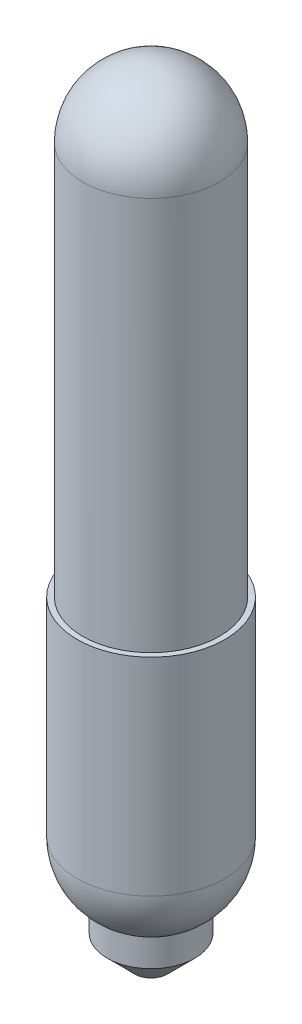
ISO-10303-21;
HEADER;
FILE_DESCRIPTION(('STEP AP214'),'2;1');
FILE_NAME('part.step','',(''),(''),'','','');
FILE_SCHEMA(('AUTOMOTIVE_DESIGN { 1 0 10303 214 1 1 1 1 }'));
ENDSEC;
DATA;
#1=APPLICATION_CONTEXT('core data for automotive mechanical design processes');
#2=APPLICATION_PROTOCOL_DEFINITION('international standard','automotive_design',2000,#1);
#3=PRODUCT_CONTEXT('',#1,'mechanical');
#4=PRODUCT('Part','Part','',(#3));
#5=PRODUCT_RELATED_PRODUCT_CATEGORY('part','',(#4));
#6=PRODUCT_DEFINITION_FORMATION('','',#4);
#7=PRODUCT_DEFINITION_CONTEXT('part definition',#1,'design');
#8=PRODUCT_DEFINITION('design','',#6,#7);
#9=PRODUCT_DEFINITION_SHAPE('','',#8);
#10=(LENGTH_UNIT() NAMED_UNIT(*) SI_UNIT(.MILLI.,.METRE.));
#11=(NAMED_UNIT(*) PLANE_ANGLE_UNIT() SI_UNIT($,.RADIAN.));
#12=(NAMED_UNIT(*) SI_UNIT($,.STERADIAN.) SOLID_ANGLE_UNIT());
#13=UNCERTAINTY_MEASURE_WITH_UNIT(LENGTH_MEASURE(1.E-05),#10,'distance_accuracy_value','');
#14=(GEOMETRIC_REPRESENTATION_CONTEXT(3) GLOBAL_UNCERTAINTY_ASSIGNED_CONTEXT((#13)) GLOBAL_UNIT_ASSIGNED_CONTEXT((#10,
#11,#12)) REPRESENTATION_CONTEXT('',''));
#15=CARTESIAN_POINT('',(0.,0.,0.));
#16=DIRECTION('',(0.,0.,1.));
#17=DIRECTION('',(1.,0.,0.));
#18=AXIS2_PLACEMENT_3D('',#15,#16,#17);
#19=CARTESIAN_POINT('',(0.,0.,0.));
#20=DIRECTION('',(0.,-1.,0.));
#21=DIRECTION('',(1.,0.,0.));
#22=AXIS2_PLACEMENT_3D('',#19,#20,#21);
#23=PLANE('',#22);
#24=CARTESIAN_POINT('',(0.,0.,0.));
#25=DIRECTION('',(0.,-1.,0.));
#26=DIRECTION('',(1.,0.,0.));
#27=AXIS2_PLACEMENT_3D('',#24,#25,#26);
#28=CIRCLE('',#27,0.380999999999998);
#29=CARTESIAN_POINT('',(0.380999999999998,0.,0.));
#30=VERTEX_POINT('',#29);
#31=EDGE_CURVE('E45',#30,#30,#28,.T.);
#32=ORIENTED_EDGE('',*,*,#31,.T.);
#33=EDGE_LOOP('',(#32));
#34=FACE_BOUND('',#33,.T.);
#35=ADVANCED_FACE('F37',(#34),#23,.T.);
#36=CARTESIAN_POINT('',(0.,0.,0.));
#37=DIRECTION('',(0.,-1.,0.));
#38=DIRECTION('',(1.,0.,0.));
#39=AXIS2_PLACEMENT_3D('',#36,#37,#38);
#40=CYLINDRICAL_SURFACE('',#39,1.016);
#41=CARTESIAN_POINT('',(0.,0.635000000000007,0.));
#42=DIRECTION('',(0.,-1.,0.));
#43=DIRECTION('',(1.,0.,0.));
#44=AXIS2_PLACEMENT_3D('',#41,#42,#43);
#45=CIRCLE('',#44,1.016);
#46=CARTESIAN_POINT('',(1.016,0.635000000000006,0.));
#47=VERTEX_POINT('',#46);
#48=EDGE_CURVE('E10',#47,#47,#45,.F.);
#49=ORIENTED_EDGE('',*,*,#48,.T.);
#50=EDGE_LOOP('',(#49));
#51=FACE_BOUND('',#50,.T.);
#52=CARTESIAN_POINT('',(0.,1.27,0.));
#53=DIRECTION('',(0.,-1.,0.));
#54=DIRECTION('',(1.,0.,0.));
#55=AXIS2_PLACEMENT_3D('',#52,#53,#54);
#56=CIRCLE('',#55,1.016);
#57=CARTESIAN_POINT('',(1.016,1.27,0.));
#58=VERTEX_POINT('',#57);
#59=EDGE_CURVE('E58',#58,#58,#56,.T.);
#60=ORIENTED_EDGE('',*,*,#59,.T.);
#61=EDGE_LOOP('',(#60));
#62=FACE_BOUND('',#61,.T.);
#63=ADVANCED_FACE('F86',(#51,#62),#40,.T.);
#64=CARTESIAN_POINT('',(0.,0.,0.));
#65=DIRECTION('',(0.,-1.,0.));
#66=DIRECTION('',(1.,0.,0.));
#67=AXIS2_PLACEMENT_3D('',#64,#65,#66);
#68=CYLINDRICAL_SURFACE('',#67,1.7145);
#69=CARTESIAN_POINT('',(0.,2.58523201375271,0.));
#70=DIRECTION('',(0.,-1.,0.));
#71=DIRECTION('',(1.,0.,0.));
#72=AXIS2_PLACEMENT_3D('',#69,#70,#71);
#73=CIRCLE('',#72,1.7145);
#74=CARTESIAN_POINT('',(1.7145,2.58523201375271,0.));
#75=VERTEX_POINT('',#74);
#76=EDGE_CURVE('E53',#75,#75,#73,.F.);
#77=ORIENTED_EDGE('',*,*,#76,.T.);
#78=EDGE_LOOP('',(#77));
#79=FACE_BOUND('',#78,.T.);
#80=CARTESIAN_POINT('',(0.,7.3914,0.));
#81=DIRECTION('',(0.,-1.,0.));
#82=DIRECTION('',(1.,0.,0.));
#83=AXIS2_PLACEMENT_3D('',#80,#81,#82);
#84=CIRCLE('',#83,1.7145);
#85=CARTESIAN_POINT('',(1.7145,7.3914,0.));
#86=VERTEX_POINT('',#85);
#87=EDGE_CURVE('E61',#86,#86,#84,.T.);
#88=ORIENTED_EDGE('',*,*,#87,.T.);
#89=EDGE_LOOP('',(#88));
#90=FACE_BOUND('',#89,.T.);
#91=ADVANCED_FACE('F83',(#79,#90),#68,.T.);
#92=CARTESIAN_POINT('',(1.7145,7.3914,0.));
#93=DIRECTION('',(0.,1.,0.));
#94=DIRECTION('',(-1.,0.,0.));
#95=AXIS2_PLACEMENT_3D('',#92,#93,#94);
#96=PLANE('',#95);
#97=CARTESIAN_POINT('',(0.,7.3914,0.));
#98=DIRECTION('',(0.,-1.,0.));
#99=DIRECTION('',(1.,0.,0.));
#100=AXIS2_PLACEMENT_3D('',#97,#98,#99);
#101=CIRCLE('',#100,1.5875);
#102=CARTESIAN_POINT('',(1.5875,7.3914,0.));
#103=VERTEX_POINT('',#102);
#104=EDGE_CURVE('E64',#103,#103,#101,.T.);
#105=ORIENTED_EDGE('',*,*,#104,.T.);
#106=EDGE_LOOP('',(#105));
#107=FACE_BOUND('',#106,.T.);
#108=ORIENTED_EDGE('',*,*,#87,.F.);
#109=EDGE_LOOP('',(#108));
#110=FACE_BOUND('',#109,.T.);
#111=ADVANCED_FACE('F68',(#107,#110),#96,.T.);
#112=CARTESIAN_POINT('',(0.,0.,0.));
#113=DIRECTION('',(0.,-1.,0.));
#114=DIRECTION('',(1.,0.,0.));
#115=AXIS2_PLACEMENT_3D('',#112,#113,#114);
#116=CYLINDRICAL_SURFACE('',#115,1.5875);
#117=CARTESIAN_POINT('',(0.,16.5227,0.));
#118=DIRECTION('',(0.,-1.,0.));
#119=DIRECTION('',(1.,0.,0.));
#120=AXIS2_PLACEMENT_3D('',#117,#118,#119);
#121=CIRCLE('',#120,1.5875);
#122=CARTESIAN_POINT('',(1.5875,16.5227,0.));
#123=VERTEX_POINT('',#122);
#124=EDGE_CURVE('E49',#123,#123,#121,.T.);
#125=ORIENTED_EDGE('',*,*,#124,.T.);
#126=EDGE_LOOP('',(#125));
#127=FACE_BOUND('',#126,.T.);
#128=ORIENTED_EDGE('',*,*,#104,.F.);
#129=EDGE_LOOP('',(#128));
#130=FACE_BOUND('',#129,.T.);
#131=ADVANCED_FACE('F71',(#127,#130),#116,.T.);
#132=CARTESIAN_POINT('',(0.,2.58523201375271,0.));
#133=DIRECTION('',(0.,-1.,0.));
#134=DIRECTION('',(1.,0.,0.));
#135=AXIS2_PLACEMENT_3D('',#132,#133,#134);
#136=DEGENERATE_TOROIDAL_SURFACE('',#135,0.127000000000001,1.5875,.T.);
#137=ORIENTED_EDGE('',*,*,#76,.F.);
#138=EDGE_LOOP('',(#137));
#139=FACE_BOUND('',#138,.T.);
#140=ORIENTED_EDGE('',*,*,#59,.F.);
#141=EDGE_LOOP('',(#140));
#142=FACE_BOUND('',#141,.T.);
#143=ADVANCED_FACE('F73',(#139,#142),#136,.T.);
#144=CARTESIAN_POINT('',(0.,16.5227,0.));
#145=DIRECTION('',(0.,1.,0.));
#146=DIRECTION('',(-1.,0.,0.));
#147=AXIS2_PLACEMENT_3D('',#144,#145,#146);
#148=SPHERICAL_SURFACE('',#147,1.5875);
#149=ORIENTED_EDGE('',*,*,#124,.F.);
#150=EDGE_LOOP('',(#149));
#151=FACE_BOUND('',#150,.T.);
#152=ADVANCED_FACE('F80',(#151),#148,.T.);
#153=CARTESIAN_POINT('',(0.,0.,0.));
#154=DIRECTION('',(0.,1.,0.));
#155=DIRECTION('',(-1.,0.,0.));
#156=AXIS2_PLACEMENT_3D('',#153,#154,#155);
#157=CONICAL_SURFACE('',#156,0.380999999999998,0.785398163397447);
#158=ORIENTED_EDGE('',*,*,#48,.F.);
#159=EDGE_LOOP('',(#158));
#160=FACE_BOUND('',#159,.T.);
#161=ORIENTED_EDGE('',*,*,#31,.F.);
#162=EDGE_LOOP('',(#161));
#163=FACE_BOUND('',#162,.T.);
#164=ADVANCED_FACE('F40',(#160,#163),#157,.T.);
#165=CLOSED_SHELL('',(#35,#63,#91,#111,#131,#143,#152,#164));
#166=MANIFOLD_SOLID_BREP('B2',#165);
#167=ADVANCED_BREP_SHAPE_REPRESENTATION('',(#18,#166),#14);
#168=SHAPE_DEFINITION_REPRESENTATION(#9,#167);
ENDSEC;
END-ISO-10303-21;
